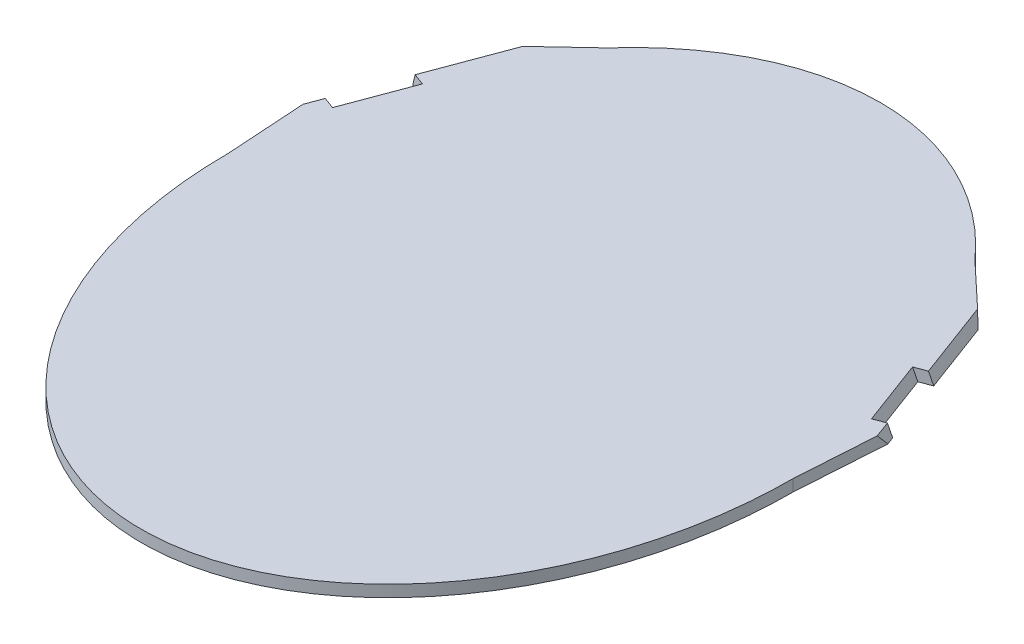
ISO-10303-21;
HEADER;
FILE_DESCRIPTION(('STEP AP214'),'2;1');
FILE_NAME('part.step','',(''),(''),'','','');
FILE_SCHEMA(('AUTOMOTIVE_DESIGN { 1 0 10303 214 1 1 1 1 }'));
ENDSEC;
DATA;
#1=APPLICATION_CONTEXT('core data for automotive mechanical design processes');
#2=APPLICATION_PROTOCOL_DEFINITION('international standard','automotive_design',2000,#1);
#3=PRODUCT_CONTEXT('',#1,'mechanical');
#4=PRODUCT('Part','Part','',(#3));
#5=PRODUCT_RELATED_PRODUCT_CATEGORY('part','',(#4));
#6=PRODUCT_DEFINITION_FORMATION('','',#4);
#7=PRODUCT_DEFINITION_CONTEXT('part definition',#1,'design');
#8=PRODUCT_DEFINITION('design','',#6,#7);
#9=PRODUCT_DEFINITION_SHAPE('','',#8);
#10=(LENGTH_UNIT() NAMED_UNIT(*) SI_UNIT(.MILLI.,.METRE.));
#11=(NAMED_UNIT(*) PLANE_ANGLE_UNIT() SI_UNIT($,.RADIAN.));
#12=(NAMED_UNIT(*) SI_UNIT($,.STERADIAN.) SOLID_ANGLE_UNIT());
#13=UNCERTAINTY_MEASURE_WITH_UNIT(LENGTH_MEASURE(1.E-05),#10,'distance_accuracy_value','');
#14=(GEOMETRIC_REPRESENTATION_CONTEXT(3) GLOBAL_UNCERTAINTY_ASSIGNED_CONTEXT((#13)) GLOBAL_UNIT_ASSIGNED_CONTEXT((#10,
#11,#12)) REPRESENTATION_CONTEXT('',''));
#15=CARTESIAN_POINT('',(0.,0.,0.));
#16=DIRECTION('',(0.,0.,1.));
#17=DIRECTION('',(1.,0.,0.));
#18=AXIS2_PLACEMENT_3D('',#15,#16,#17);
#19=CARTESIAN_POINT('',(0.,12.,0.));
#20=DIRECTION('',(0.,1.,0.));
#21=DIRECTION('',(0.,0.,1.));
#22=AXIS2_PLACEMENT_3D('',#19,#20,#21);
#23=PLANE('',#22);
#24=DIRECTION('',(-0.729121958040292,0.,0.68438378874977));
#25=VECTOR('',#24,1.);
#26=CARTESIAN_POINT('',(-188.989530621689,12.,-288.225103523863));
#27=LINE('',#26,#25);
#28=CARTESIAN_POINT('',(-188.989530621689,12.,-288.225103523863));
#29=VERTEX_POINT('',#28);
#30=CARTESIAN_POINT('',(-233.851633836728,12.,-246.115692565903));
#31=VERTEX_POINT('',#30);
#32=EDGE_CURVE('E158',#29,#31,#27,.T.);
#33=ORIENTED_EDGE('',*,*,#32,.T.);
#34=DIRECTION('',(-0.349563318607244,0.,0.936912742086631));
#35=VECTOR('',#34,1.);
#36=CARTESIAN_POINT('',(-285.881678201385,12.,-106.662812524588));
#37=LINE('',#36,#35);
#38=CARTESIAN_POINT('',(-263.913208732399,12.,-165.543529905464));
#39=VERTEX_POINT('',#38);
#40=EDGE_CURVE('E48',#31,#39,#37,.T.);
#41=ORIENTED_EDGE('',*,*,#40,.T.);
#42=DIRECTION('',(0.936912742086631,0.,0.349563318607245));
#43=VECTOR('',#42,1.);
#44=CARTESIAN_POINT('',(-267.84333266083,12.,-167.009864070053));
#45=LINE('',#44,#43);
#46=CARTESIAN_POINT('',(-252.00313467227,12.,-161.099866342895));
#47=VERTEX_POINT('',#46);
#48=EDGE_CURVE('E173',#39,#47,#45,.T.);
#49=ORIENTED_EDGE('',*,*,#48,.T.);
#50=DIRECTION('',(0.349563318607244,0.,-0.936912742086631));
#51=VECTOR('',#50,1.);
#52=CARTESIAN_POINT('',(-273.971604141256,12.,-102.219148962019));
#53=LINE('',#52,#51);
#54=CARTESIAN_POINT('',(-277.111119993054,12.,-93.8045006023116));
#55=VERTEX_POINT('',#54);
#56=EDGE_CURVE('E280',#55,#47,#53,.T.);
#57=ORIENTED_EDGE('',*,*,#56,.F.);
#58=DIRECTION('',(-0.936912742086633,0.,-0.349563318607241));
#59=VECTOR('',#58,1.);
#60=CARTESIAN_POINT('',(-281.041243921485,12.,-95.2708347669006));
#61=LINE('',#60,#59);
#62=CARTESIAN_POINT('',(-289.021194053183,12.,-98.2481641648805));
#63=VERTEX_POINT('',#62);
#64=EDGE_CURVE('E175',#55,#63,#61,.T.);
#65=ORIENTED_EDGE('',*,*,#64,.T.);
#66=CARTESIAN_POINT('',(-295.249619363478,12.,-81.5545046024295));
#67=VERTEX_POINT('',#66);
#68=EDGE_CURVE('E266',#63,#67,#37,.T.);
#69=ORIENTED_EDGE('',*,*,#68,.T.);
#70=DIRECTION('',(0.0642365171820713,0.,0.997934702202663));
#71=VECTOR('',#70,1.);
#72=CARTESIAN_POINT('',(-295.908396975203,12.,-91.7888240925697));
#73=LINE('',#72,#71);
#74=CARTESIAN_POINT('',(-290.,12.,-3.60776088669847E-13));
#75=VERTEX_POINT('',#74);
#76=EDGE_CURVE('E179',#67,#75,#73,.T.);
#77=ORIENTED_EDGE('',*,*,#76,.T.);
#78=CARTESIAN_POINT('',(0.,12.,0.));
#79=DIRECTION('',(0.,1.,0.));
#80=DIRECTION('',(0.,0.,-1.));
#81=AXIS2_PLACEMENT_3D('',#78,#79,#80);
#82=ELLIPSE('',#81,380.,290.);
#83=CARTESIAN_POINT('',(290.,12.,0.));
#84=VERTEX_POINT('',#83);
#85=EDGE_CURVE('E202',#75,#84,#82,.T.);
#86=ORIENTED_EDGE('',*,*,#85,.T.);
#87=DIRECTION('',(0.0642365171820712,0.,-0.997934702202663));
#88=VECTOR('',#87,1.);
#89=CARTESIAN_POINT('',(290.,12.,0.));
#90=LINE('',#89,#88);
#91=CARTESIAN_POINT('',(295.249619363478,12.,-81.5545046024294));
#92=VERTEX_POINT('',#91);
#93=EDGE_CURVE('E181',#84,#92,#90,.T.);
#94=ORIENTED_EDGE('',*,*,#93,.T.);
#95=DIRECTION('',(-0.349563318607244,0.,-0.936912742086631));
#96=VECTOR('',#95,1.);
#97=CARTESIAN_POINT('',(285.881678201385,12.,-106.662812524588));
#98=LINE('',#97,#96);
#99=CARTESIAN_POINT('',(289.021194053183,12.,-98.2481641648806));
#100=VERTEX_POINT('',#99);
#101=EDGE_CURVE('E55',#92,#100,#98,.T.);
#102=ORIENTED_EDGE('',*,*,#101,.T.);
#103=DIRECTION('',(-0.936912742086632,0.,0.349563318607242));
#104=VECTOR('',#103,1.);
#105=CARTESIAN_POINT('',(292.951317981614,12.,-99.7144983294693));
#106=LINE('',#105,#104);
#107=CARTESIAN_POINT('',(277.111119993054,12.,-93.8045006023116));
#108=VERTEX_POINT('',#107);
#109=EDGE_CURVE('E184',#100,#108,#106,.T.);
#110=ORIENTED_EDGE('',*,*,#109,.T.);
#111=DIRECTION('',(0.349563318607244,0.,0.936912742086631));
#112=VECTOR('',#111,1.);
#113=CARTESIAN_POINT('',(273.971604141256,12.,-102.219148962019));
#114=LINE('',#113,#112);
#115=CARTESIAN_POINT('',(252.00313467227,12.,-161.099866342895));
#116=VERTEX_POINT('',#115);
#117=EDGE_CURVE('E176',#116,#108,#114,.T.);
#118=ORIENTED_EDGE('',*,*,#117,.F.);
#119=DIRECTION('',(0.936912742086631,0.,-0.349563318607245));
#120=VECTOR('',#119,1.);
#121=CARTESIAN_POINT('',(255.933258600701,12.,-162.566200507484));
#122=LINE('',#121,#120);
#123=CARTESIAN_POINT('',(263.913208732399,12.,-165.543529905464));
#124=VERTEX_POINT('',#123);
#125=EDGE_CURVE('E186',#116,#124,#122,.T.);
#126=ORIENTED_EDGE('',*,*,#125,.T.);
#127=CARTESIAN_POINT('',(233.851633836728,12.,-246.115692565903));
#128=VERTEX_POINT('',#127);
#129=EDGE_CURVE('E251',#124,#128,#98,.T.);
#130=ORIENTED_EDGE('',*,*,#129,.T.);
#131=DIRECTION('',(-0.729121958040291,0.,-0.684383788749771));
#132=VECTOR('',#131,1.);
#133=CARTESIAN_POINT('',(240.741863407573,12.,-239.648240355678));
#134=LINE('',#133,#132);
#135=CARTESIAN_POINT('',(188.989530621688,12.,-288.225103523865));
#136=VERTEX_POINT('',#135);
#137=EDGE_CURVE('E189',#128,#136,#134,.T.);
#138=ORIENTED_EDGE('',*,*,#137,.T.);
#139=EDGE_CURVE('E198',#136,#29,#82,.T.);
#140=ORIENTED_EDGE('',*,*,#139,.T.);
#141=EDGE_LOOP('',(#33,#41,#49,#57,#65,#69,#77,#86,#94,#102,#110,#118,#126,#130,#138,#140));
#142=FACE_BOUND('',#141,.T.);
#143=ADVANCED_FACE('F32',(#142),#23,.T.);
#144=CARTESIAN_POINT('',(-281.041243921485,0.,-95.2708347669006));
#145=DIRECTION('',(0.349563318607241,0.,-0.936912742086632));
#146=DIRECTION('',(-0.936912742086633,0.,-0.349563318607241));
#147=AXIS2_PLACEMENT_3D('',#144,#145,#146);
#148=PLANE('',#147);
#149=DIRECTION('',(-0.936912742086633,0.,-0.349563318607241));
#150=VECTOR('',#149,1.);
#151=CARTESIAN_POINT('',(-281.041243921485,0.,-95.2708347669006));
#152=LINE('',#151,#150);
#153=CARTESIAN_POINT('',(-281.041243921485,-2.29383414455141E-12,-95.2708347669005));
#154=VERTEX_POINT('',#153);
#155=CARTESIAN_POINT('',(-292.951317981614,-1.76635401601924E-12,-99.7144983294693));
#156=VERTEX_POINT('',#155);
#157=EDGE_CURVE('E301',#154,#156,#152,.T.);
#158=ORIENTED_EDGE('',*,*,#157,.T.);
#159=DIRECTION('',(0.309165431544453,0.943986817233753,0.115350010085918));
#160=VECTOR('',#159,1.);
#161=CARTESIAN_POINT('',(-291.654443250622,3.95979797464443,-99.230632741545));
#162=LINE('',#161,#160);
#163=EDGE_CURVE('E263',#156,#63,#162,.T.);
#164=ORIENTED_EDGE('',*,*,#163,.T.);
#165=ORIENTED_EDGE('',*,*,#64,.F.);
#166=DIRECTION('',(-0.309165431544448,-0.943986817233753,-0.115350010085931));
#167=VECTOR('',#166,1.);
#168=CARTESIAN_POINT('',(-282.338118652476,-3.95979797464487,-95.7547003548245));
#169=LINE('',#168,#167);
#170=EDGE_CURVE('E257',#55,#154,#169,.T.);
#171=ORIENTED_EDGE('',*,*,#170,.T.);
#172=EDGE_LOOP('',(#158,#164,#165,#171));
#173=FACE_BOUND('',#172,.T.);
#174=ADVANCED_FACE('F310',(#173),#148,.T.);
#175=CARTESIAN_POINT('',(-295.908396975203,0.,-91.7888240925697));
#176=DIRECTION('',(-0.997934702202663,0.,0.0642365171820713));
#177=DIRECTION('',(0.0642365171820713,0.,0.997934702202663));
#178=AXIS2_PLACEMENT_3D('',#175,#176,#177);
#179=PLANE('',#178);
#180=ORIENTED_EDGE('',*,*,#76,.F.);
#181=DIRECTION('',(-0.0417336482239322,-0.760201576030198,-0.648345483833369));
#182=VECTOR('',#181,1.);
#183=CARTESIAN_POINT('',(-295.908396975203,-4.52665473087651E-13,-91.7888240925691));
#184=LINE('',#183,#182);
#185=CARTESIAN_POINT('',(-295.908396975203,0.,-91.7888240925697));
#186=VERTEX_POINT('',#185);
#187=EDGE_CURVE('E269',#67,#186,#184,.T.);
#188=ORIENTED_EDGE('',*,*,#187,.T.);
#189=DIRECTION('',(0.0642365171820713,0.,0.997934702202663));
#190=VECTOR('',#189,1.);
#191=CARTESIAN_POINT('',(-295.908396975203,0.,-91.7888240925697));
#192=LINE('',#191,#190);
#193=CARTESIAN_POINT('',(-290.,0.,-3.76949899044593E-13));
#194=VERTEX_POINT('',#193);
#195=EDGE_CURVE('E223',#186,#194,#192,.T.);
#196=ORIENTED_EDGE('',*,*,#195,.T.);
#197=DIRECTION('',(0.,1.,0.));
#198=VECTOR('',#197,1.);
#199=CARTESIAN_POINT('',(-290.,0.,-3.76949899044593E-13));
#200=LINE('',#199,#198);
#201=EDGE_CURVE('E163',#194,#75,#200,.T.);
#202=ORIENTED_EDGE('',*,*,#201,.T.);
#203=EDGE_LOOP('',(#180,#188,#196,#202));
#204=FACE_BOUND('',#203,.T.);
#205=ADVANCED_FACE('F308',(#204),#179,.T.);
#206=CARTESIAN_POINT('',(-267.84333266083,0.,-167.009864070053));
#207=DIRECTION('',(-0.349563318607246,0.,0.936912742086631));
#208=DIRECTION('',(0.936912742086631,0.,0.349563318607246));
#209=AXIS2_PLACEMENT_3D('',#206,#207,#208);
#210=PLANE('',#209);
#211=ORIENTED_EDGE('',*,*,#48,.F.);
#212=DIRECTION('',(-0.309165431544452,-0.943986817233753,-0.11535001008592));
#213=VECTOR('',#212,1.);
#214=CARTESIAN_POINT('',(-267.84333266083,-1.92336326188763E-13,-167.009864070052));
#215=LINE('',#214,#213);
#216=CARTESIAN_POINT('',(-267.84333266083,-1.78257139060895E-12,-167.009864070053));
#217=VERTEX_POINT('',#216);
#218=EDGE_CURVE('E273',#39,#217,#215,.T.);
#219=ORIENTED_EDGE('',*,*,#218,.T.);
#220=DIRECTION('',(0.936912742086631,0.,0.349563318607245));
#221=VECTOR('',#220,1.);
#222=CARTESIAN_POINT('',(-267.84333266083,0.,-167.009864070053));
#223=LINE('',#222,#221);
#224=CARTESIAN_POINT('',(-255.933258600701,0.,-162.566200507483));
#225=VERTEX_POINT('',#224);
#226=EDGE_CURVE('E157',#217,#225,#223,.T.);
#227=ORIENTED_EDGE('',*,*,#226,.T.);
#228=DIRECTION('',(0.309165431544454,0.943986817233752,0.115350010085918));
#229=VECTOR('',#228,1.);
#230=CARTESIAN_POINT('',(-247.859116821861,24.6530906176201,-159.553728087874));
#231=LINE('',#230,#229);
#232=EDGE_CURVE('E285',#225,#47,#231,.T.);
#233=ORIENTED_EDGE('',*,*,#232,.T.);
#234=EDGE_LOOP('',(#211,#219,#227,#233));
#235=FACE_BOUND('',#234,.T.);
#236=ADVANCED_FACE('F276',(#235),#210,.T.);
#237=CARTESIAN_POINT('',(-188.989530621689,0.,-288.225103523863));
#238=DIRECTION('',(-0.68438378874977,0.,-0.729121958040292));
#239=DIRECTION('',(-0.729121958040292,0.,0.68438378874977));
#240=AXIS2_PLACEMENT_3D('',#237,#238,#239);
#241=PLANE('',#240);
#242=DIRECTION('',(-0.729121958040292,0.,0.68438378874977));
#243=VECTOR('',#242,1.);
#244=CARTESIAN_POINT('',(-188.989530621689,0.,-288.225103523863));
#245=LINE('',#244,#243);
#246=CARTESIAN_POINT('',(-188.989530621689,0.,-288.225103523863));
#247=VERTEX_POINT('',#246);
#248=CARTESIAN_POINT('',(-240.741863407573,0.,-239.648240355679));
#249=VERTEX_POINT('',#248);
#250=EDGE_CURVE('E155',#247,#249,#245,.T.);
#251=ORIENTED_EDGE('',*,*,#250,.T.);
#252=DIRECTION('',(0.451100535627729,0.785635133325328,-0.423421473287869));
#253=VECTOR('',#252,1.);
#254=CARTESIAN_POINT('',(-220.932238090277,34.5003749676806,-258.242367550536));
#255=LINE('',#254,#253);
#256=EDGE_CURVE('E11',#249,#31,#255,.T.);
#257=ORIENTED_EDGE('',*,*,#256,.T.);
#258=ORIENTED_EDGE('',*,*,#32,.F.);
#259=DIRECTION('',(0.,1.,0.));
#260=VECTOR('',#259,1.);
#261=CARTESIAN_POINT('',(-188.989530621689,0.,-288.225103523863));
#262=LINE('',#261,#260);
#263=EDGE_CURVE('E162',#247,#29,#262,.T.);
#264=ORIENTED_EDGE('',*,*,#263,.F.);
#265=EDGE_LOOP('',(#251,#257,#258,#264));
#266=FACE_BOUND('',#265,.T.);
#267=ADVANCED_FACE('F160',(#266),#241,.T.);
#268=CARTESIAN_POINT('',(255.933258600701,0.,-162.566200507484));
#269=DIRECTION('',(0.349563318607246,0.,0.936912742086631));
#270=DIRECTION('',(0.936912742086631,0.,-0.349563318607246));
#271=AXIS2_PLACEMENT_3D('',#268,#269,#270);
#272=PLANE('',#271);
#273=DIRECTION('',(0.936912742086631,0.,-0.349563318607245));
#274=VECTOR('',#273,1.);
#275=CARTESIAN_POINT('',(255.933258600701,0.,-162.566200507484));
#276=LINE('',#275,#274);
#277=CARTESIAN_POINT('',(255.9332586007,0.,-162.566200507484));
#278=VERTEX_POINT('',#277);
#279=CARTESIAN_POINT('',(267.84333266083,-1.76635401601924E-12,-167.009864070053));
#280=VERTEX_POINT('',#279);
#281=EDGE_CURVE('E236',#278,#280,#276,.T.);
#282=ORIENTED_EDGE('',*,*,#281,.T.);
#283=DIRECTION('',(-0.309165431544452,0.943986817233753,0.11535001008592));
#284=VECTOR('',#283,1.);
#285=CARTESIAN_POINT('',(266.546457929838,3.95979797464444,-166.525998482128));
#286=LINE('',#285,#284);
#287=EDGE_CURVE('E245',#280,#124,#286,.T.);
#288=ORIENTED_EDGE('',*,*,#287,.T.);
#289=ORIENTED_EDGE('',*,*,#125,.F.);
#290=DIRECTION('',(-0.309165431544445,0.943986817233753,0.115350010085938));
#291=VECTOR('',#290,1.);
#292=CARTESIAN_POINT('',(252.00313467227,11.9999999999999,-161.099866342895));
#293=LINE('',#292,#291);
#294=EDGE_CURVE('E293',#278,#116,#293,.T.);
#295=ORIENTED_EDGE('',*,*,#294,.F.);
#296=EDGE_LOOP('',(#282,#288,#289,#295));
#297=FACE_BOUND('',#296,.T.);
#298=ADVANCED_FACE('F335',(#297),#272,.T.);
#299=CARTESIAN_POINT('',(240.741863407573,0.,-239.648240355678));
#300=DIRECTION('',(0.684383788749771,0.,-0.729121958040291));
#301=DIRECTION('',(-0.729121958040291,0.,-0.684383788749771));
#302=AXIS2_PLACEMENT_3D('',#299,#300,#301);
#303=PLANE('',#302);
#304=ORIENTED_EDGE('',*,*,#137,.F.);
#305=DIRECTION('',(0.451100535627729,-0.785635133325328,0.42342147328787));
#306=VECTOR('',#305,1.);
#307=CARTESIAN_POINT('',(240.741863407573,-4.02452656898648E-13,-239.648240355679));
#308=LINE('',#307,#306);
#309=CARTESIAN_POINT('',(240.741863407573,0.,-239.648240355678));
#310=VERTEX_POINT('',#309);
#311=EDGE_CURVE('E242',#128,#310,#308,.T.);
#312=ORIENTED_EDGE('',*,*,#311,.T.);
#313=DIRECTION('',(-0.729121958040291,0.,-0.684383788749771));
#314=VECTOR('',#313,1.);
#315=CARTESIAN_POINT('',(240.741863407573,0.,-239.648240355678));
#316=LINE('',#315,#314);
#317=CARTESIAN_POINT('',(188.989530621689,0.,-288.225103523863));
#318=VERTEX_POINT('',#317);
#319=EDGE_CURVE('E164',#310,#318,#316,.T.);
#320=ORIENTED_EDGE('',*,*,#319,.T.);
#321=DIRECTION('',(0.,1.,0.));
#322=VECTOR('',#321,1.);
#323=CARTESIAN_POINT('',(188.989530621689,0.,-288.225103523863));
#324=LINE('',#323,#322);
#325=EDGE_CURVE('E194',#318,#136,#324,.T.);
#326=ORIENTED_EDGE('',*,*,#325,.T.);
#327=EDGE_LOOP('',(#304,#312,#320,#326));
#328=FACE_BOUND('',#327,.T.);
#329=ADVANCED_FACE('F249',(#328),#303,.T.);
#330=CARTESIAN_POINT('',(292.951317981614,0.,-99.7144983294693));
#331=DIRECTION('',(-0.349563318607242,0.,-0.936912742086632));
#332=DIRECTION('',(-0.936912742086632,0.,0.349563318607242));
#333=AXIS2_PLACEMENT_3D('',#330,#331,#332);
#334=PLANE('',#333);
#335=ORIENTED_EDGE('',*,*,#109,.F.);
#336=DIRECTION('',(0.309165431544453,-0.943986817233753,-0.115350010085919));
#337=VECTOR('',#336,1.);
#338=CARTESIAN_POINT('',(292.951317981614,-1.74018580837452E-13,-99.7144983294691));
#339=LINE('',#338,#337);
#340=CARTESIAN_POINT('',(292.951317981614,-1.58803084472832E-12,-99.7144983294693));
#341=VERTEX_POINT('',#340);
#342=EDGE_CURVE('E260',#100,#341,#339,.T.);
#343=ORIENTED_EDGE('',*,*,#342,.T.);
#344=DIRECTION('',(-0.936912742086632,0.,0.349563318607242));
#345=VECTOR('',#344,1.);
#346=CARTESIAN_POINT('',(292.951317981614,0.,-99.7144983294693));
#347=LINE('',#346,#345);
#348=CARTESIAN_POINT('',(281.041243921485,0.,-95.2708347669006));
#349=VERTEX_POINT('',#348);
#350=EDGE_CURVE('E225',#341,#349,#347,.T.);
#351=ORIENTED_EDGE('',*,*,#350,.T.);
#352=DIRECTION('',(0.309165431544448,-0.943986817233753,-0.115350010085931));
#353=VECTOR('',#352,1.);
#354=CARTESIAN_POINT('',(282.338118652476,-3.95979797464487,-95.7547003548245));
#355=LINE('',#354,#353);
#356=EDGE_CURVE('E287',#108,#349,#355,.T.);
#357=ORIENTED_EDGE('',*,*,#356,.F.);
#358=EDGE_LOOP('',(#335,#343,#351,#357));
#359=FACE_BOUND('',#358,.T.);
#360=ADVANCED_FACE('F329',(#359),#334,.T.);
#361=CARTESIAN_POINT('',(290.,0.,0.));
#362=DIRECTION('',(0.997934702202663,0.,0.0642365171820712));
#363=DIRECTION('',(0.0642365171820712,0.,-0.997934702202663));
#364=AXIS2_PLACEMENT_3D('',#361,#362,#363);
#365=PLANE('',#364);
#366=DIRECTION('',(0.0642365171820712,0.,-0.997934702202663));
#367=VECTOR('',#366,1.);
#368=CARTESIAN_POINT('',(290.,0.,0.));
#369=LINE('',#368,#367);
#370=CARTESIAN_POINT('',(290.,0.,0.));
#371=VERTEX_POINT('',#370);
#372=CARTESIAN_POINT('',(295.908396975203,0.,-91.7888240925687));
#373=VERTEX_POINT('',#372);
#374=EDGE_CURVE('E218',#371,#373,#369,.T.);
#375=ORIENTED_EDGE('',*,*,#374,.T.);
#376=DIRECTION('',(-0.0417336482239321,0.760201576030197,0.648345483833369));
#377=VECTOR('',#376,1.);
#378=CARTESIAN_POINT('',(293.414500639587,45.4277065503183,-53.0453522142146));
#379=LINE('',#378,#377);
#380=EDGE_CURVE('E41',#373,#92,#379,.T.);
#381=ORIENTED_EDGE('',*,*,#380,.T.);
#382=ORIENTED_EDGE('',*,*,#93,.F.);
#383=DIRECTION('',(0.,1.,0.));
#384=VECTOR('',#383,1.);
#385=CARTESIAN_POINT('',(290.,0.,0.));
#386=LINE('',#385,#384);
#387=EDGE_CURVE('E167',#371,#84,#386,.T.);
#388=ORIENTED_EDGE('',*,*,#387,.F.);
#389=EDGE_LOOP('',(#375,#381,#382,#388));
#390=FACE_BOUND('',#389,.T.);
#391=ADVANCED_FACE('F217',(#390),#365,.T.);
#392=CARTESIAN_POINT('',(0.,0.,0.));
#393=DIRECTION('',(0.,1.,0.));
#394=DIRECTION('',(0.,0.,1.));
#395=AXIS2_PLACEMENT_3D('',#392,#393,#394);
#396=PLANE('',#395);
#397=DIRECTION('',(-0.349563318607244,0.,0.936912742086631));
#398=VECTOR('',#397,1.);
#399=CARTESIAN_POINT('',(-255.933258600701,0.,-162.566200507484));
#400=LINE('',#399,#398);
#401=EDGE_CURVE('E299',#225,#154,#400,.T.);
#402=ORIENTED_EDGE('',*,*,#401,.F.);
#403=ORIENTED_EDGE('',*,*,#226,.F.);
#404=DIRECTION('',(-0.349563318607248,0.,0.93691274208663));
#405=VECTOR('',#404,1.);
#406=CARTESIAN_POINT('',(-240.741863407573,0.,-239.648240355679));
#407=LINE('',#406,#405);
#408=EDGE_CURVE('E144',#249,#217,#407,.T.);
#409=ORIENTED_EDGE('',*,*,#408,.F.);
#410=ORIENTED_EDGE('',*,*,#250,.F.);
#411=CARTESIAN_POINT('',(0.,0.,0.));
#412=DIRECTION('',(0.,1.,0.));
#413=DIRECTION('',(0.,0.,-1.));
#414=AXIS2_PLACEMENT_3D('',#411,#412,#413);
#415=ELLIPSE('',#414,380.,290.);
#416=EDGE_CURVE('E193',#318,#247,#415,.T.);
#417=ORIENTED_EDGE('',*,*,#416,.F.);
#418=ORIENTED_EDGE('',*,*,#319,.F.);
#419=DIRECTION('',(-0.349563318607247,0.,-0.93691274208663));
#420=VECTOR('',#419,1.);
#421=CARTESIAN_POINT('',(267.84333266083,0.,-167.009864070053));
#422=LINE('',#421,#420);
#423=EDGE_CURVE('E169',#280,#310,#422,.T.);
#424=ORIENTED_EDGE('',*,*,#423,.F.);
#425=ORIENTED_EDGE('',*,*,#281,.F.);
#426=DIRECTION('',(-0.349563318607244,0.,-0.936912742086631));
#427=VECTOR('',#426,1.);
#428=CARTESIAN_POINT('',(281.041243921485,0.,-95.2708347669006));
#429=LINE('',#428,#427);
#430=EDGE_CURVE('E233',#349,#278,#429,.T.);
#431=ORIENTED_EDGE('',*,*,#430,.F.);
#432=ORIENTED_EDGE('',*,*,#350,.F.);
#433=DIRECTION('',(-0.349563318607216,0.,-0.936912742086642));
#434=VECTOR('',#433,1.);
#435=CARTESIAN_POINT('',(295.908396975203,0.,-91.7888240925694));
#436=LINE('',#435,#434);
#437=EDGE_CURVE('E222',#373,#341,#436,.T.);
#438=ORIENTED_EDGE('',*,*,#437,.F.);
#439=ORIENTED_EDGE('',*,*,#374,.F.);
#440=EDGE_CURVE('E203',#194,#371,#415,.T.);
#441=ORIENTED_EDGE('',*,*,#440,.F.);
#442=ORIENTED_EDGE('',*,*,#195,.F.);
#443=DIRECTION('',(-0.349563318607218,0.,0.936912742086641));
#444=VECTOR('',#443,1.);
#445=CARTESIAN_POINT('',(-292.951317981614,0.,-99.7144983294693));
#446=LINE('',#445,#444);
#447=EDGE_CURVE('E227',#156,#186,#446,.T.);
#448=ORIENTED_EDGE('',*,*,#447,.F.);
#449=ORIENTED_EDGE('',*,*,#157,.F.);
#450=EDGE_LOOP('',(#402,#403,#409,#410,#417,#418,#424,#425,#431,#432,#438,#439,#441,#442,#448,#449));
#451=FACE_BOUND('',#450,.T.);
#452=ADVANCED_FACE('F153',(#451),#396,.F.);
#453=DIRECTION('',(0.,-1.,0.));
#454=VECTOR('',#453,1.);
#455=SURFACE_OF_LINEAR_EXTRUSION('',#82,#454);
#456=ORIENTED_EDGE('',*,*,#416,.T.);
#457=ORIENTED_EDGE('',*,*,#263,.T.);
#458=ORIENTED_EDGE('',*,*,#139,.F.);
#459=ORIENTED_EDGE('',*,*,#325,.F.);
#460=EDGE_LOOP('',(#456,#457,#458,#459));
#461=FACE_BOUND('',#460,.T.);
#462=ADVANCED_FACE('F34',(#461),#455,.F.);
#463=ORIENTED_EDGE('',*,*,#440,.T.);
#464=ORIENTED_EDGE('',*,*,#387,.T.);
#465=ORIENTED_EDGE('',*,*,#85,.F.);
#466=ORIENTED_EDGE('',*,*,#201,.F.);
#467=EDGE_LOOP('',(#463,#464,#465,#466));
#468=FACE_BOUND('',#467,.T.);
#469=ADVANCED_FACE('F214',(#468),#455,.F.);
#470=CARTESIAN_POINT('',(272.967102142645,24.6530906176201,-92.2583623472905));
#471=DIRECTION('',(-0.884433277428107,-0.329983164553722,0.32998316455372));
#472=DIRECTION('',(0.349563318607245,-0.936912742086631,0.));
#473=AXIS2_PLACEMENT_3D('',#470,#471,#472);
#474=PLANE('',#473);
#475=ORIENTED_EDGE('',*,*,#117,.T.);
#476=ORIENTED_EDGE('',*,*,#356,.T.);
#477=ORIENTED_EDGE('',*,*,#430,.T.);
#478=ORIENTED_EDGE('',*,*,#294,.T.);
#479=EDGE_LOOP('',(#475,#476,#477,#478));
#480=FACE_BOUND('',#479,.T.);
#481=ADVANCED_FACE('F343',(#480),#474,.F.);
#482=CARTESIAN_POINT('',(-272.967102142645,24.6530906176201,-92.2583623472905));
#483=DIRECTION('',(0.884433277428107,-0.329983164553722,0.32998316455372));
#484=DIRECTION('',(-0.349563318607245,-0.936912742086631,0.));
#485=AXIS2_PLACEMENT_3D('',#482,#483,#484);
#486=PLANE('',#485);
#487=ORIENTED_EDGE('',*,*,#56,.T.);
#488=ORIENTED_EDGE('',*,*,#232,.F.);
#489=ORIENTED_EDGE('',*,*,#401,.T.);
#490=ORIENTED_EDGE('',*,*,#170,.F.);
#491=EDGE_LOOP('',(#487,#488,#489,#490));
#492=FACE_BOUND('',#491,.T.);
#493=ADVANCED_FACE('F284',(#492),#486,.F.);
#494=CARTESIAN_POINT('',(378.222381299528,-114.455171598149,14.3770382113808));
#495=DIRECTION('',(0.884433277428107,0.329983164553723,-0.32998316455372));
#496=DIRECTION('',(-0.349563318607246,0.936912742086631,0.));
#497=AXIS2_PLACEMENT_3D('',#494,#495,#496);
#498=PLANE('',#497);
#499=ORIENTED_EDGE('',*,*,#380,.F.);
#500=ORIENTED_EDGE('',*,*,#437,.T.);
#501=ORIENTED_EDGE('',*,*,#342,.F.);
#502=ORIENTED_EDGE('',*,*,#101,.F.);
#503=EDGE_LOOP('',(#499,#500,#501,#502));
#504=FACE_BOUND('',#503,.T.);
#505=ADVANCED_FACE('F349',(#504),#498,.T.);
#506=ORIENTED_EDGE('',*,*,#423,.T.);
#507=ORIENTED_EDGE('',*,*,#311,.F.);
#508=ORIENTED_EDGE('',*,*,#129,.F.);
#509=ORIENTED_EDGE('',*,*,#287,.F.);
#510=EDGE_LOOP('',(#506,#507,#508,#509));
#511=FACE_BOUND('',#510,.T.);
#512=ADVANCED_FACE('F241',(#511),#498,.T.);
#513=CARTESIAN_POINT('',(-378.222381299528,-114.455171598149,14.3770382113808));
#514=DIRECTION('',(-0.884433277428107,0.329983164553723,-0.32998316455372));
#515=DIRECTION('',(0.349563318607246,0.936912742086631,0.));
#516=AXIS2_PLACEMENT_3D('',#513,#514,#515);
#517=PLANE('',#516);
#518=ORIENTED_EDGE('',*,*,#256,.F.);
#519=ORIENTED_EDGE('',*,*,#408,.T.);
#520=ORIENTED_EDGE('',*,*,#218,.F.);
#521=ORIENTED_EDGE('',*,*,#40,.F.);
#522=EDGE_LOOP('',(#518,#519,#520,#521));
#523=FACE_BOUND('',#522,.T.);
#524=ADVANCED_FACE('F143',(#523),#517,.T.);
#525=ORIENTED_EDGE('',*,*,#447,.T.);
#526=ORIENTED_EDGE('',*,*,#187,.F.);
#527=ORIENTED_EDGE('',*,*,#68,.F.);
#528=ORIENTED_EDGE('',*,*,#163,.F.);
#529=EDGE_LOOP('',(#525,#526,#527,#528));
#530=FACE_BOUND('',#529,.T.);
#531=ADVANCED_FACE('F305',(#530),#517,.T.);
#532=CLOSED_SHELL('',(#143,#174,#205,#236,#267,#298,#329,#360,#391,#452,#462,#469,#481,#493,
#505,#512,#524,#531));
#533=MANIFOLD_SOLID_BREP('B2',#532);
#534=ADVANCED_BREP_SHAPE_REPRESENTATION('',(#18,#533),#14);
#535=SHAPE_DEFINITION_REPRESENTATION(#9,#534);
ENDSEC;
END-ISO-10303-21;
